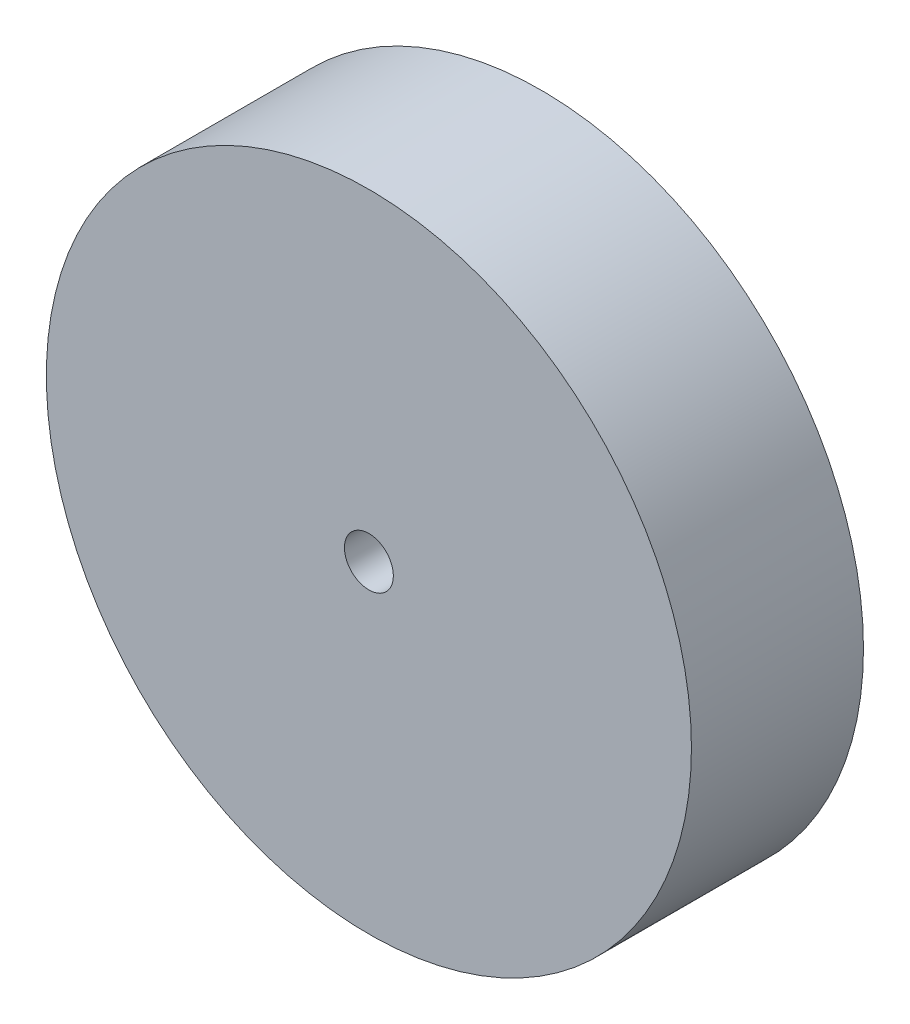
ISO-10303-21;
HEADER;
FILE_DESCRIPTION(('STEP AP214'),'2;1');
FILE_NAME('part.step','',(''),(''),'','','');
FILE_SCHEMA(('AUTOMOTIVE_DESIGN { 1 0 10303 214 1 1 1 1 }'));
ENDSEC;
DATA;
#1=APPLICATION_CONTEXT('core data for automotive mechanical design processes');
#2=APPLICATION_PROTOCOL_DEFINITION('international standard','automotive_design',2000,#1);
#3=PRODUCT_CONTEXT('',#1,'mechanical');
#4=PRODUCT('Part','Part','',(#3));
#5=PRODUCT_RELATED_PRODUCT_CATEGORY('part','',(#4));
#6=PRODUCT_DEFINITION_FORMATION('','',#4);
#7=PRODUCT_DEFINITION_CONTEXT('part definition',#1,'design');
#8=PRODUCT_DEFINITION('design','',#6,#7);
#9=PRODUCT_DEFINITION_SHAPE('','',#8);
#10=(LENGTH_UNIT() NAMED_UNIT(*) SI_UNIT(.MILLI.,.METRE.));
#11=(NAMED_UNIT(*) PLANE_ANGLE_UNIT() SI_UNIT($,.RADIAN.));
#12=(NAMED_UNIT(*) SI_UNIT($,.STERADIAN.) SOLID_ANGLE_UNIT());
#13=UNCERTAINTY_MEASURE_WITH_UNIT(LENGTH_MEASURE(1.E-05),#10,'distance_accuracy_value','');
#14=(GEOMETRIC_REPRESENTATION_CONTEXT(3) GLOBAL_UNCERTAINTY_ASSIGNED_CONTEXT((#13)) GLOBAL_UNIT_ASSIGNED_CONTEXT((#10,
#11,#12)) REPRESENTATION_CONTEXT('',''));
#15=CARTESIAN_POINT('',(0.,0.,0.));
#16=DIRECTION('',(0.,0.,1.));
#17=DIRECTION('',(1.,0.,0.));
#18=AXIS2_PLACEMENT_3D('',#15,#16,#17);
#19=CARTESIAN_POINT('',(0.,0.,40.));
#20=DIRECTION('',(0.,0.,1.));
#21=DIRECTION('',(1.,0.,0.));
#22=AXIS2_PLACEMENT_3D('',#19,#20,#21);
#23=PLANE('',#22);
#24=CARTESIAN_POINT('',(0.,0.,40.));
#25=DIRECTION('',(0.,0.,1.));
#26=DIRECTION('',(1.,0.,0.));
#27=AXIS2_PLACEMENT_3D('',#24,#25,#26);
#28=CIRCLE('',#27,75.);
#29=CARTESIAN_POINT('',(75.,0.,40.));
#30=VERTEX_POINT('',#29);
#31=EDGE_CURVE('E10',#30,#30,#28,.T.);
#32=ORIENTED_EDGE('',*,*,#31,.T.);
#33=EDGE_LOOP('',(#32));
#34=FACE_BOUND('',#33,.T.);
#35=CARTESIAN_POINT('',(0.,0.,40.));
#36=DIRECTION('',(0.,0.,1.));
#37=DIRECTION('',(1.,0.,0.));
#38=AXIS2_PLACEMENT_3D('',#35,#36,#37);
#39=CIRCLE('',#38,5.68587489521954);
#40=CARTESIAN_POINT('',(5.68587489521954,0.,40.));
#41=VERTEX_POINT('',#40);
#42=EDGE_CURVE('E42',#41,#41,#39,.T.);
#43=ORIENTED_EDGE('',*,*,#42,.F.);
#44=EDGE_LOOP('',(#43));
#45=FACE_BOUND('',#44,.T.);
#46=ADVANCED_FACE('F31',(#34,#45),#23,.T.);
#47=CARTESIAN_POINT('',(0.,0.,0.));
#48=DIRECTION('',(0.,0.,1.));
#49=DIRECTION('',(1.,0.,0.));
#50=AXIS2_PLACEMENT_3D('',#47,#48,#49);
#51=PLANE('',#50);
#52=CARTESIAN_POINT('',(0.,0.,0.));
#53=DIRECTION('',(0.,0.,1.));
#54=DIRECTION('',(1.,0.,0.));
#55=AXIS2_PLACEMENT_3D('',#52,#53,#54);
#56=CIRCLE('',#55,75.);
#57=CARTESIAN_POINT('',(75.,0.,0.));
#58=VERTEX_POINT('',#57);
#59=EDGE_CURVE('E35',#58,#58,#56,.T.);
#60=ORIENTED_EDGE('',*,*,#59,.F.);
#61=EDGE_LOOP('',(#60));
#62=FACE_BOUND('',#61,.T.);
#63=CARTESIAN_POINT('',(0.,0.,0.));
#64=DIRECTION('',(0.,0.,1.));
#65=DIRECTION('',(1.,0.,0.));
#66=AXIS2_PLACEMENT_3D('',#63,#64,#65);
#67=CIRCLE('',#66,5.68587489521954);
#68=CARTESIAN_POINT('',(5.68587489521954,0.,0.));
#69=VERTEX_POINT('',#68);
#70=EDGE_CURVE('E44',#69,#69,#67,.T.);
#71=ORIENTED_EDGE('',*,*,#70,.T.);
#72=EDGE_LOOP('',(#71));
#73=FACE_BOUND('',#72,.T.);
#74=ADVANCED_FACE('F54',(#62,#73),#51,.F.);
#75=CARTESIAN_POINT('',(0.,0.,40.));
#76=DIRECTION('',(0.,0.,-1.));
#77=DIRECTION('',(-1.,0.,0.));
#78=AXIS2_PLACEMENT_3D('',#75,#76,#77);
#79=CYLINDRICAL_SURFACE('',#78,75.);
#80=ORIENTED_EDGE('',*,*,#31,.F.);
#81=EDGE_LOOP('',(#80));
#82=FACE_BOUND('',#81,.T.);
#83=ORIENTED_EDGE('',*,*,#59,.T.);
#84=EDGE_LOOP('',(#83));
#85=FACE_BOUND('',#84,.T.);
#86=ADVANCED_FACE('F33',(#82,#85),#79,.T.);
#87=CARTESIAN_POINT('',(0.,0.,40.));
#88=DIRECTION('',(0.,0.,-1.));
#89=DIRECTION('',(-1.,0.,0.));
#90=AXIS2_PLACEMENT_3D('',#87,#88,#89);
#91=CYLINDRICAL_SURFACE('',#90,5.68587489521954);
#92=ORIENTED_EDGE('',*,*,#42,.T.);
#93=EDGE_LOOP('',(#92));
#94=FACE_BOUND('',#93,.T.);
#95=ORIENTED_EDGE('',*,*,#70,.F.);
#96=EDGE_LOOP('',(#95));
#97=FACE_BOUND('',#96,.T.);
#98=ADVANCED_FACE('F50',(#94,#97),#91,.F.);
#99=CLOSED_SHELL('',(#46,#74,#86,#98));
#100=MANIFOLD_SOLID_BREP('B2',#99);
#101=ADVANCED_BREP_SHAPE_REPRESENTATION('',(#18,#100),#14);
#102=SHAPE_DEFINITION_REPRESENTATION(#9,#101);
ENDSEC;
END-ISO-10303-21;
